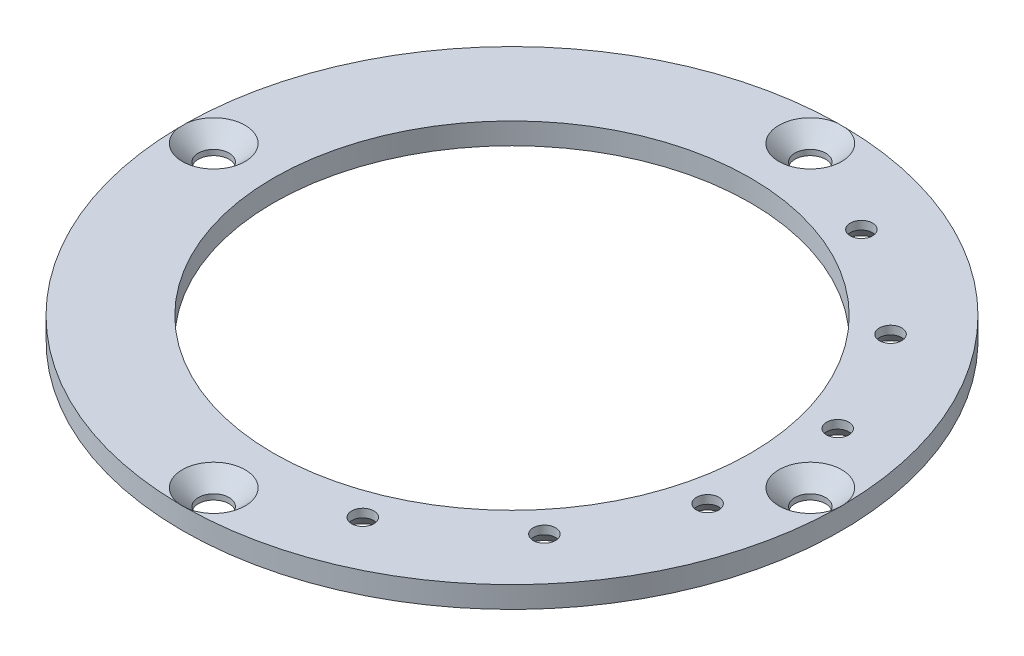
ISO-10303-21;
HEADER;
FILE_DESCRIPTION(('STEP AP214'),'2;1');
FILE_NAME('part.step','',(''),(''),'','','');
FILE_SCHEMA(('AUTOMOTIVE_DESIGN { 1 0 10303 214 1 1 1 1 }'));
ENDSEC;
DATA;
#1=APPLICATION_CONTEXT('core data for automotive mechanical design processes');
#2=APPLICATION_PROTOCOL_DEFINITION('international standard','automotive_design',2000,#1);
#3=PRODUCT_CONTEXT('',#1,'mechanical');
#4=PRODUCT('Part','Part','',(#3));
#5=PRODUCT_RELATED_PRODUCT_CATEGORY('part','',(#4));
#6=PRODUCT_DEFINITION_FORMATION('','',#4);
#7=PRODUCT_DEFINITION_CONTEXT('part definition',#1,'design');
#8=PRODUCT_DEFINITION('design','',#6,#7);
#9=PRODUCT_DEFINITION_SHAPE('','',#8);
#10=(LENGTH_UNIT() NAMED_UNIT(*) SI_UNIT(.MILLI.,.METRE.));
#11=(NAMED_UNIT(*) PLANE_ANGLE_UNIT() SI_UNIT($,.RADIAN.));
#12=(NAMED_UNIT(*) SI_UNIT($,.STERADIAN.) SOLID_ANGLE_UNIT());
#13=UNCERTAINTY_MEASURE_WITH_UNIT(LENGTH_MEASURE(1.E-05),#10,'distance_accuracy_value','');
#14=(GEOMETRIC_REPRESENTATION_CONTEXT(3) GLOBAL_UNCERTAINTY_ASSIGNED_CONTEXT((#13)) GLOBAL_UNIT_ASSIGNED_CONTEXT((#10,
#11,#12)) REPRESENTATION_CONTEXT('',''));
#15=CARTESIAN_POINT('',(0.,0.,0.));
#16=DIRECTION('',(0.,0.,1.));
#17=DIRECTION('',(1.,0.,0.));
#18=AXIS2_PLACEMENT_3D('',#15,#16,#17);
#19=CARTESIAN_POINT('',(0.,-43.48226,0.));
#20=DIRECTION('',(0.,1.,0.));
#21=DIRECTION('',(0.,0.,1.));
#22=AXIS2_PLACEMENT_3D('',#19,#20,#21);
#23=PLANE('',#22);
#24=CARTESIAN_POINT('',(14.6578770054185,-43.48226,-36.5145494448616));
#25=DIRECTION('',(0.,-1.,0.));
#26=DIRECTION('',(0.,0.,-1.));
#27=AXIS2_PLACEMENT_3D('',#24,#25,#26);
#28=CIRCLE('',#27,3.302);
#29=CARTESIAN_POINT('',(14.6578770054185,-43.48226,-39.8165494448616));
#30=VERTEX_POINT('',#29);
#31=EDGE_CURVE('E174',#30,#30,#28,.T.);
#32=ORIENTED_EDGE('',*,*,#31,.F.);
#33=EDGE_LOOP('',(#32));
#34=FACE_BOUND('',#33,.T.);
#35=CARTESIAN_POINT('',(0.,-43.48226,43.688));
#36=DIRECTION('',(0.,1.,0.));
#37=DIRECTION('',(0.,0.,1.));
#38=AXIS2_PLACEMENT_3D('',#35,#36,#37);
#39=CIRCLE('',#38,2.25);
#40=CARTESIAN_POINT('',(0.,-43.48226,45.938));
#41=VERTEX_POINT('',#40);
#42=EDGE_CURVE('E180',#41,#41,#39,.T.);
#43=ORIENTED_EDGE('',*,*,#42,.T.);
#44=EDGE_LOOP('',(#43));
#45=FACE_BOUND('',#44,.T.);
#46=CARTESIAN_POINT('',(43.688,-43.48226,0.));
#47=DIRECTION('',(0.,1.,0.));
#48=DIRECTION('',(0.,0.,1.));
#49=AXIS2_PLACEMENT_3D('',#46,#47,#48);
#50=CIRCLE('',#49,2.25);
#51=CARTESIAN_POINT('',(43.688,-43.48226,2.25));
#52=VERTEX_POINT('',#51);
#53=EDGE_CURVE('E188',#52,#52,#50,.T.);
#54=ORIENTED_EDGE('',*,*,#53,.T.);
#55=EDGE_LOOP('',(#54));
#56=FACE_BOUND('',#55,.T.);
#57=CARTESIAN_POINT('',(0.,-43.48226,-43.688));
#58=DIRECTION('',(0.,1.,0.));
#59=DIRECTION('',(0.,0.,1.));
#60=AXIS2_PLACEMENT_3D('',#57,#58,#59);
#61=CIRCLE('',#60,2.25);
#62=CARTESIAN_POINT('',(0.,-43.48226,-41.438));
#63=VERTEX_POINT('',#62);
#64=EDGE_CURVE('E197',#63,#63,#61,.T.);
#65=ORIENTED_EDGE('',*,*,#64,.T.);
#66=EDGE_LOOP('',(#65));
#67=FACE_BOUND('',#66,.T.);
#68=CARTESIAN_POINT('',(-43.688,-43.48226,0.));
#69=DIRECTION('',(0.,1.,0.));
#70=DIRECTION('',(0.,0.,1.));
#71=AXIS2_PLACEMENT_3D('',#68,#69,#70);
#72=CIRCLE('',#71,2.25);
#73=CARTESIAN_POINT('',(-43.688,-43.48226,2.25));
#74=VERTEX_POINT('',#73);
#75=EDGE_CURVE('E206',#74,#74,#72,.T.);
#76=ORIENTED_EDGE('',*,*,#75,.T.);
#77=EDGE_LOOP('',(#76));
#78=FACE_BOUND('',#77,.T.);
#79=CARTESIAN_POINT('',(0.,-43.48226,0.));
#80=DIRECTION('',(0.,1.,0.));
#81=DIRECTION('',(0.,0.,1.));
#82=AXIS2_PLACEMENT_3D('',#79,#80,#81);
#83=CIRCLE('',#82,48.26);
#84=CARTESIAN_POINT('',(0.,-43.48226,48.26));
#85=VERTEX_POINT('',#84);
#86=EDGE_CURVE('E111',#85,#85,#83,.F.);
#87=ORIENTED_EDGE('',*,*,#86,.T.);
#88=EDGE_LOOP('',(#87));
#89=FACE_BOUND('',#88,.T.);
#90=CARTESIAN_POINT('',(0.,-43.48226,0.));
#91=DIRECTION('',(0.,1.,0.));
#92=DIRECTION('',(0.,0.,1.));
#93=AXIS2_PLACEMENT_3D('',#90,#91,#92);
#94=CIRCLE('',#93,34.925);
#95=CARTESIAN_POINT('',(0.,-43.48226,34.925));
#96=VERTEX_POINT('',#95);
#97=EDGE_CURVE('E103',#96,#96,#94,.F.);
#98=ORIENTED_EDGE('',*,*,#97,.F.);
#99=EDGE_LOOP('',(#98));
#100=FACE_BOUND('',#99,.T.);
#101=CARTESIAN_POINT('',(30.0928655825076,-43.48226,-25.3492627210408));
#102=DIRECTION('',(0.,-1.,0.));
#103=DIRECTION('',(0.,0.,-1.));
#104=AXIS2_PLACEMENT_3D('',#101,#102,#103);
#105=CIRCLE('',#104,3.302);
#106=CARTESIAN_POINT('',(30.0928655825076,-43.48226,-28.6512627210408));
#107=VERTEX_POINT('',#106);
#108=EDGE_CURVE('E217',#107,#107,#105,.T.);
#109=ORIENTED_EDGE('',*,*,#108,.F.);
#110=EDGE_LOOP('',(#109));
#111=FACE_BOUND('',#110,.T.);
#112=CARTESIAN_POINT('',(38.1764332339628,-43.48226,-9.525));
#113=DIRECTION('',(0.,-1.,0.));
#114=DIRECTION('',(0.,0.,-1.));
#115=AXIS2_PLACEMENT_3D('',#112,#113,#114);
#116=CIRCLE('',#115,3.302);
#117=CARTESIAN_POINT('',(38.1764332339628,-43.48226,-12.827));
#118=VERTEX_POINT('',#117);
#119=EDGE_CURVE('E221',#118,#118,#116,.T.);
#120=ORIENTED_EDGE('',*,*,#119,.F.);
#121=EDGE_LOOP('',(#120));
#122=FACE_BOUND('',#121,.T.);
#123=CARTESIAN_POINT('',(38.1764332339628,-43.48226,9.525));
#124=DIRECTION('',(0.,-1.,0.));
#125=DIRECTION('',(0.,0.,-1.));
#126=AXIS2_PLACEMENT_3D('',#123,#124,#125);
#127=CIRCLE('',#126,3.302);
#128=CARTESIAN_POINT('',(38.1764332339628,-43.48226,6.223));
#129=VERTEX_POINT('',#128);
#130=EDGE_CURVE('E225',#129,#129,#127,.T.);
#131=ORIENTED_EDGE('',*,*,#130,.F.);
#132=EDGE_LOOP('',(#131));
#133=FACE_BOUND('',#132,.T.);
#134=CARTESIAN_POINT('',(30.0928655825076,-43.48226,25.3492627210408));
#135=DIRECTION('',(0.,-1.,0.));
#136=DIRECTION('',(0.,0.,-1.));
#137=AXIS2_PLACEMENT_3D('',#134,#135,#136);
#138=CIRCLE('',#137,3.302);
#139=CARTESIAN_POINT('',(30.0928655825076,-43.48226,22.0472627210408));
#140=VERTEX_POINT('',#139);
#141=EDGE_CURVE('E229',#140,#140,#138,.T.);
#142=ORIENTED_EDGE('',*,*,#141,.F.);
#143=EDGE_LOOP('',(#142));
#144=FACE_BOUND('',#143,.T.);
#145=CARTESIAN_POINT('',(14.6578770054184,-43.48226,36.5145494448616));
#146=DIRECTION('',(0.,-1.,0.));
#147=DIRECTION('',(0.,0.,-1.));
#148=AXIS2_PLACEMENT_3D('',#145,#146,#147);
#149=CIRCLE('',#148,3.302);
#150=CARTESIAN_POINT('',(14.6578770054184,-43.48226,33.2125494448616));
#151=VERTEX_POINT('',#150);
#152=EDGE_CURVE('E232',#151,#151,#149,.T.);
#153=ORIENTED_EDGE('',*,*,#152,.F.);
#154=EDGE_LOOP('',(#153));
#155=FACE_BOUND('',#154,.T.);
#156=ADVANCED_FACE('F42',(#34,#45,#56,#67,#78,#89,#100,#111,#122,#133,#144,#155),#23,.F.);
#157=CARTESIAN_POINT('',(0.,-179.982153040251,0.));
#158=DIRECTION('',(0.,1.,0.));
#159=DIRECTION('',(0.,0.,1.));
#160=AXIS2_PLACEMENT_3D('',#157,#158,#159);
#161=CYLINDRICAL_SURFACE('',#160,48.26);
#162=CARTESIAN_POINT('',(-4.43511365443474,-38.7078966717899,48.0557735019659));
#163=CARTESIAN_POINT('',(-4.3206800452195,-38.7820031314783,48.0663336499546));
#164=CARTESIAN_POINT('',(-4.20551369527138,-38.8550467916644,48.0765512327605));
#165=CARTESIAN_POINT('',(-3.97349761758106,-38.9985901295011,48.0962836738619));
#166=CARTESIAN_POINT('',(-3.85664736107759,-39.069088982582,48.1057983054137));
#167=CARTESIAN_POINT('',(-3.62031278244212,-39.2075483961708,48.1241630765065));
#168=CARTESIAN_POINT('',(-3.50081590532765,-39.2754882798996,48.1330082220251));
#169=CARTESIAN_POINT('',(-3.25978483419257,-39.4077337186415,48.1499325184922));
#170=CARTESIAN_POINT('',(-3.13825082839658,-39.4720396070509,48.1580117397557));
#171=CARTESIAN_POINT('',(-2.89129216778441,-39.5971653720733,48.1734733195204));
#172=CARTESIAN_POINT('',(-2.76583725544716,-39.6579274301162,48.1808449666575));
#173=CARTESIAN_POINT('',(-2.51245269859545,-39.7741493468478,48.1947227627606));
#174=CARTESIAN_POINT('',(-2.38452269348176,-39.8296084258379,48.2012287845082));
#175=CARTESIAN_POINT('',(-1.99749095493958,-39.9862153271572,48.2193332777023));
#176=CARTESIAN_POINT('',(-1.734298560819,-40.0780374659836,48.2295721736229));
#177=CARTESIAN_POINT('',(-1.3899651809606,-40.1737024120904,48.2400398840253));
#178=CARTESIAN_POINT('',(-1.31319618467855,-40.1935112961486,48.2421918080597));
#179=CARTESIAN_POINT('',(-1.15891422673548,-40.2300924726776,48.246144637927));
#180=CARTESIAN_POINT('',(-1.08140115894505,-40.2468643249806,48.2479454928811));
#181=CARTESIAN_POINT('',(-0.848353988689384,-40.2921986542366,48.2527923869871));
#182=CARTESIAN_POINT('',(-0.691829539323482,-40.3159163741734,48.2552975399763));
#183=CARTESIAN_POINT('',(-0.3572103836872,-40.351107855491,48.2590035264591));
#184=CARTESIAN_POINT('',(-0.178904349426157,-40.3606405684994,48.2599979315682));
#185=CARTESIAN_POINT('',(0.178116710733451,-40.3606794052499,48.2600020657617));
#186=CARTESIAN_POINT('',(0.356831771339242,-40.3511435193675,48.2590074127944));
#187=CARTESIAN_POINT('',(0.670128644816814,-40.3182018006531,48.2555381167261));
#188=CARTESIAN_POINT('',(0.805137595163514,-40.298616134564,48.2534698206685));
#189=CARTESIAN_POINT('',(1.07343277468439,-40.2496369235557,48.2482471245083));
#190=CARTESIAN_POINT('',(1.206717726047,-40.2202364932956,48.2450919618877));
#191=CARTESIAN_POINT('',(1.47079910683963,-40.1527758900891,48.2377630105055));
#192=CARTESIAN_POINT('',(1.6015989930196,-40.1147288729097,48.2335907685349));
#193=CARTESIAN_POINT('',(1.86054533245197,-40.0311716975152,48.2242961909687));
#194=CARTESIAN_POINT('',(1.98869558010789,-39.9856731845126,48.2191753362556));
#195=CARTESIAN_POINT('',(2.11553812765031,-39.9369979899687,48.2136090583401));
#196=B_SPLINE_CURVE_WITH_KNOTS('',3,(#162,#163,#164,#165,#166,#167,#168,#169,#170,#171,#172,
#173,#174,#175,#176,#177,#178,#179,#180,#181,#182,#183,#184,#185,#186,#187,#188,#189,#190,#191,
#192,#193,#194,#195),.UNSPECIFIED.,.F.,.F.,(4,2,2,2,2,2,2,2,2,2,2,2,2,2,2,2,4),(0.,
0.410234899965599,0.82060155258797,1.2337770491434,1.64691457768576,2.06555315814155,
2.48425319682157,3.3187823671808,3.5566737995499,3.79459968283002,4.26895150121379,
4.80363744333187,5.33950263844922,5.74844447776585,6.15767380660287,6.56628461353248,
6.97426283175265),.UNSPECIFIED.);
#197=CARTESIAN_POINT('',(-0.532619427072993,-40.33266,48.2570607947263));
#198=VERTEX_POINT('',#197);
#199=CARTESIAN_POINT('',(0.532619427073456,-40.33266,48.2570607947262));
#200=VERTEX_POINT('',#199);
#201=EDGE_CURVE('E11',#198,#200,#196,.T.);
#202=ORIENTED_EDGE('',*,*,#201,.F.);
#203=CARTESIAN_POINT('',(0.,-40.33266,0.));
#204=DIRECTION('',(0.,1.,0.));
#205=DIRECTION('',(0.,0.,1.));
#206=AXIS2_PLACEMENT_3D('',#203,#204,#205);
#207=CIRCLE('',#206,48.26);
#208=CARTESIAN_POINT('',(-48.2570607947262,-40.33266,0.532619427073456));
#209=VERTEX_POINT('',#208);
#210=EDGE_CURVE('E94',#209,#198,#207,.T.);
#211=ORIENTED_EDGE('',*,*,#210,.F.);
#212=CARTESIAN_POINT('',(-48.0557735019659,-38.7078966717899,-4.43511365443474));
#213=CARTESIAN_POINT('',(-48.0663336499546,-38.7820031314783,-4.32068004521949));
#214=CARTESIAN_POINT('',(-48.0765512327605,-38.8550467916644,-4.20551369527138));
#215=CARTESIAN_POINT('',(-48.0962836738619,-38.9985901295011,-3.97349761758106));
#216=CARTESIAN_POINT('',(-48.1057983054137,-39.069088982582,-3.85664736107759));
#217=CARTESIAN_POINT('',(-48.1241630765065,-39.2075483961708,-3.62031278244212));
#218=CARTESIAN_POINT('',(-48.1330082220251,-39.2754882798996,-3.50081590532765));
#219=CARTESIAN_POINT('',(-48.1499325184922,-39.4077337186415,-3.25978483419257));
#220=CARTESIAN_POINT('',(-48.1580117397557,-39.4720396070508,-3.13825082839658));
#221=CARTESIAN_POINT('',(-48.1734733195204,-39.5971653720733,-2.89129216778442));
#222=CARTESIAN_POINT('',(-48.1808449666575,-39.6579274301162,-2.76583725544717));
#223=CARTESIAN_POINT('',(-48.1947227627606,-39.7741493468478,-2.51245269859546));
#224=CARTESIAN_POINT('',(-48.2012287845082,-39.8296084258379,-2.38452269348177));
#225=CARTESIAN_POINT('',(-48.2193332777023,-39.9862153271572,-1.99749095493959));
#226=CARTESIAN_POINT('',(-48.2295721736229,-40.0780374659836,-1.73429856081901));
#227=CARTESIAN_POINT('',(-48.2400398840253,-40.1737024120904,-1.3899651809606));
#228=CARTESIAN_POINT('',(-48.2421918080597,-40.1935112961486,-1.31319618467855));
#229=CARTESIAN_POINT('',(-48.246144637927,-40.2300924726776,-1.15891422673549));
#230=CARTESIAN_POINT('',(-48.2479454928811,-40.2468643249806,-1.08140115894505));
#231=CARTESIAN_POINT('',(-48.2527923869871,-40.2921986542366,-0.848353988689384));
#232=CARTESIAN_POINT('',(-48.2552975399763,-40.3159163741735,-0.69182953932348));
#233=CARTESIAN_POINT('',(-48.2590035264591,-40.351107855491,-0.357210383687196));
#234=CARTESIAN_POINT('',(-48.2599979315682,-40.3606405684994,-0.178904349426154));
#235=CARTESIAN_POINT('',(-48.2600020657617,-40.3606794052499,0.178116710733453));
#236=CARTESIAN_POINT('',(-48.2590074127944,-40.3511435193675,0.356831771339243));
#237=CARTESIAN_POINT('',(-48.2555381167261,-40.3182018006531,0.670128644816814));
#238=CARTESIAN_POINT('',(-48.2534698206685,-40.298616134564,0.805137595163514));
#239=CARTESIAN_POINT('',(-48.2482471245083,-40.2496369235557,1.07343277468439));
#240=CARTESIAN_POINT('',(-48.2450919618877,-40.2202364932956,1.206717726047));
#241=CARTESIAN_POINT('',(-48.2377630105055,-40.1527758900891,1.47079910683962));
#242=CARTESIAN_POINT('',(-48.2335907685349,-40.1147288729097,1.6015989930196));
#243=CARTESIAN_POINT('',(-48.2242961909687,-40.0311716975152,1.86054533245197));
#244=CARTESIAN_POINT('',(-48.2191753362556,-39.9856731845126,1.98869558010789));
#245=CARTESIAN_POINT('',(-48.2136090583401,-39.9369979899687,2.11553812765031));
#246=B_SPLINE_CURVE_WITH_KNOTS('',3,(#212,#213,#214,#215,#216,#217,#218,#219,#220,#221,#222,
#223,#224,#225,#226,#227,#228,#229,#230,#231,#232,#233,#234,#235,#236,#237,#238,#239,#240,#241,
#242,#243,#244,#245),.UNSPECIFIED.,.F.,.F.,(4,2,2,2,2,2,2,2,2,2,2,2,2,2,2,2,4),(0.,
0.410234899965598,0.820601552587967,1.2337770491434,1.64691457768575,2.06555315814153,
2.48425319682155,3.31878236718079,3.5566737995499,3.79459968283002,4.2689515012138,
4.80363744333187,5.33950263844921,5.74844447776585,6.15767380660287,6.56628461353248,
6.97426283175264),.UNSPECIFIED.);
#247=CARTESIAN_POINT('',(-48.2570607947263,-40.33266,-0.532619427072989));
#248=VERTEX_POINT('',#247);
#249=EDGE_CURVE('E112',#248,#209,#246,.T.);
#250=ORIENTED_EDGE('',*,*,#249,.F.);
#251=CARTESIAN_POINT('',(-0.532619427073456,-40.33266,-48.2570607947262));
#252=VERTEX_POINT('',#251);
#253=EDGE_CURVE('E104',#252,#248,#207,.T.);
#254=ORIENTED_EDGE('',*,*,#253,.F.);
#255=CARTESIAN_POINT('',(2.11553812765031,-39.9369979899687,-48.2136090583401));
#256=CARTESIAN_POINT('',(1.98873401290734,-39.985658423565,-48.2191736484954));
#257=CARTESIAN_POINT('',(1.86062305429761,-40.0311440966863,-48.224293084562));
#258=CARTESIAN_POINT('',(1.6017577450666,-40.1146801682437,-48.2335853869341));
#259=CARTESIAN_POINT('',(1.47099962023972,-40.1527189841909,-48.2377567802949));
#260=CARTESIAN_POINT('',(1.20692223507146,-40.2201899305417,-48.245086951529));
#261=CARTESIAN_POINT('',(1.0735981202033,-40.2496035887385,-48.2482435574381));
#262=CARTESIAN_POINT('',(0.805221795665676,-40.2986039093656,-48.2534685295766));
#263=CARTESIAN_POINT('',(0.670170844883565,-40.3181973539068,-48.2555376469039));
#264=CARTESIAN_POINT('',(0.356782634654057,-40.3511486984476,-48.2590079602111));
#265=CARTESIAN_POINT('',(0.178018165509056,-40.3606846771676,-48.2600026246289));
#266=CARTESIAN_POINT('',(-0.17900416299521,-40.3606352827661,-48.2599973712942));
#267=CARTESIAN_POINT('',(-0.357262061665193,-40.3511024995423,-48.2590029392877));
#268=CARTESIAN_POINT('',(-0.700893501169603,-40.3149630544468,-48.2551971683644));
#269=CARTESIAN_POINT('',(-0.866385679058802,-40.2894415521649,-48.2525012305828));
#270=CARTESIAN_POINT('',(-1.19451119481474,-40.2239751754148,-48.2454941066491));
#271=CARTESIAN_POINT('',(-1.35714276033423,-40.1840216680402,-48.2411819536545));
#272=CARTESIAN_POINT('',(-1.68009332766718,-40.0914246741657,-48.2310192182759));
#273=CARTESIAN_POINT('',(-1.84038246877528,-40.0386799073589,-48.225156321824));
#274=CARTESIAN_POINT('',(-2.15706021043792,-39.9228710881826,-48.2120297218672));
#275=CARTESIAN_POINT('',(-2.31344926740518,-39.8598082498923,-48.2047661831516));
#276=CARTESIAN_POINT('',(-2.64166783089074,-39.7169634527078,-48.1879596082474));
#277=CARTESIAN_POINT('',(-2.81300444637099,-39.6360778454605,-48.1782455399448));
#278=CARTESIAN_POINT('',(-3.1514277615533,-39.4659815458656,-48.1572928063255));
#279=CARTESIAN_POINT('',(-3.31851304793247,-39.3767681298523,-48.1460536416666));
#280=CARTESIAN_POINT('',(-3.64568400680086,-39.1936271782086,-48.1223750820518));
#281=CARTESIAN_POINT('',(-3.80584263089298,-39.0998253784845,-48.109963342714));
#282=CARTESIAN_POINT('',(-4.12281850630506,-38.9072812319718,-48.0838344449272));
#283=CARTESIAN_POINT('',(-4.27963924955711,-38.8085444508772,-48.0701187420127));
#284=CARTESIAN_POINT('',(-4.43511365443474,-38.7078966717899,-48.0557735019659));
#285=B_SPLINE_CURVE_WITH_KNOTS('',3,(#255,#256,#257,#258,#259,#260,#261,#262,#263,#264,#265,
#266,#267,#268,#269,#270,#271,#272,#273,#274,#275,#276,#277,#278,#279,#280,#281,#282,#283,#284),
.UNSPECIFIED.,.F.,.F.,(4,2,2,2,2,2,2,2,2,2,2,2,2,2,4),(0.,0.407854484931988,0.816338373619181,
1.22569081378559,1.63476015294158,2.17077384028202,2.70531128912839,3.20700220334111,
3.70899371629217,4.21509776196209,4.72114229950376,5.28999849410147,5.85904139316573,
6.41699579286857,6.97433453576174),.UNSPECIFIED.);
#286=CARTESIAN_POINT('',(0.53261942707299,-40.33266,-48.2570607947263));
#287=VERTEX_POINT('',#286);
#288=EDGE_CURVE('E119',#287,#252,#285,.T.);
#289=ORIENTED_EDGE('',*,*,#288,.F.);
#290=CARTESIAN_POINT('',(48.2570607947262,-40.33266,-0.532619427073456));
#291=VERTEX_POINT('',#290);
#292=EDGE_CURVE('E101',#291,#287,#207,.T.);
#293=ORIENTED_EDGE('',*,*,#292,.F.);
#294=CARTESIAN_POINT('',(48.2136090583401,-39.9369979899687,2.11553812765031));
#295=CARTESIAN_POINT('',(48.2191736484954,-39.985658423565,1.98873401290733));
#296=CARTESIAN_POINT('',(48.224293084562,-40.0311440966863,1.86062305429761));
#297=CARTESIAN_POINT('',(48.2335853869341,-40.1146801682437,1.60175774506659));
#298=CARTESIAN_POINT('',(48.2377567802949,-40.1527189841909,1.47099962023972));
#299=CARTESIAN_POINT('',(48.245086951529,-40.2201899305417,1.20692223507146));
#300=CARTESIAN_POINT('',(48.2482435574381,-40.2496035887385,1.0735981202033));
#301=CARTESIAN_POINT('',(48.2534685295766,-40.2986039093656,0.805221795665678));
#302=CARTESIAN_POINT('',(48.2555376469039,-40.3181973539068,0.670170844883566));
#303=CARTESIAN_POINT('',(48.2590079602111,-40.3511486984476,0.356782634654057));
#304=CARTESIAN_POINT('',(48.2600026246289,-40.3606846771676,0.178018165509058));
#305=CARTESIAN_POINT('',(48.2599973712942,-40.3606352827661,-0.179004162995208));
#306=CARTESIAN_POINT('',(48.2590029392877,-40.3511024995423,-0.35726206166519));
#307=CARTESIAN_POINT('',(48.2551971683644,-40.3149630544468,-0.700893501169599));
#308=CARTESIAN_POINT('',(48.2525012305828,-40.2894415521649,-0.866385679058798));
#309=CARTESIAN_POINT('',(48.2454941066491,-40.2239751754148,-1.19451119481474));
#310=CARTESIAN_POINT('',(48.2411819536545,-40.1840216680402,-1.35714276033422));
#311=CARTESIAN_POINT('',(48.2310192182759,-40.0914246741657,-1.68009332766717));
#312=CARTESIAN_POINT('',(48.225156321824,-40.0386799073589,-1.84038246877527));
#313=CARTESIAN_POINT('',(48.2120297218672,-39.9228710881826,-2.15706021043792));
#314=CARTESIAN_POINT('',(48.2047661831516,-39.8598082498923,-2.31344926740518));
#315=CARTESIAN_POINT('',(48.1879596082474,-39.7169634527078,-2.64166783089073));
#316=CARTESIAN_POINT('',(48.1782455399448,-39.6360778454605,-2.81300444637098));
#317=CARTESIAN_POINT('',(48.1572928063255,-39.4659815458656,-3.15142776155329));
#318=CARTESIAN_POINT('',(48.1460536416666,-39.3767681298523,-3.31851304793247));
#319=CARTESIAN_POINT('',(48.1223750820518,-39.1936271782086,-3.64568400680085));
#320=CARTESIAN_POINT('',(48.109963342714,-39.0998253784845,-3.80584263089298));
#321=CARTESIAN_POINT('',(48.0838344449272,-38.9072812319718,-4.12281850630506));
#322=CARTESIAN_POINT('',(48.0701187420127,-38.8085444508772,-4.27963924955711));
#323=CARTESIAN_POINT('',(48.0557735019659,-38.7078966717899,-4.43511365443473));
#324=B_SPLINE_CURVE_WITH_KNOTS('',3,(#294,#295,#296,#297,#298,#299,#300,#301,#302,#303,#304,
#305,#306,#307,#308,#309,#310,#311,#312,#313,#314,#315,#316,#317,#318,#319,#320,#321,#322,#323),
.UNSPECIFIED.,.F.,.F.,(4,2,2,2,2,2,2,2,2,2,2,2,2,2,4),(0.,0.407854484931986,0.816338373619179,
1.22569081378558,1.63476015294157,2.17077384028201,2.70531128912839,3.20700220334111,
3.70899371629216,4.21509776196208,4.72114229950375,5.28999849410145,5.85904139316572,
6.41699579286856,6.97433453576173),.UNSPECIFIED.);
#325=CARTESIAN_POINT('',(48.2570607947263,-40.33266,0.532619427072991));
#326=VERTEX_POINT('',#325);
#327=EDGE_CURVE('E56',#326,#291,#324,.T.);
#328=ORIENTED_EDGE('',*,*,#327,.F.);
#329=EDGE_CURVE('E68',#200,#326,#207,.T.);
#330=ORIENTED_EDGE('',*,*,#329,.F.);
#331=EDGE_LOOP('',(#202,#211,#250,#254,#289,#293,#328,#330));
#332=FACE_BOUND('',#331,.T.);
#333=ORIENTED_EDGE('',*,*,#86,.F.);
#334=EDGE_LOOP('',(#333));
#335=FACE_BOUND('',#334,.T.);
#336=ADVANCED_FACE('F44',(#332,#335),#161,.T.);
#337=CARTESIAN_POINT('',(0.,-40.33266,0.));
#338=DIRECTION('',(0.,1.,0.));
#339=DIRECTION('',(0.,0.,1.));
#340=AXIS2_PLACEMENT_3D('',#337,#338,#339);
#341=PLANE('',#340);
#342=CARTESIAN_POINT('',(14.6578770054184,-40.33266,36.5145494448616));
#343=DIRECTION('',(0.,1.,0.));
#344=DIRECTION('',(0.,0.,1.));
#345=AXIS2_PLACEMENT_3D('',#342,#343,#344);
#346=CIRCLE('',#345,1.63195);
#347=CARTESIAN_POINT('',(14.6578770054184,-40.33266,38.1464994448616));
#348=VERTEX_POINT('',#347);
#349=EDGE_CURVE('E151',#348,#348,#346,.T.);
#350=ORIENTED_EDGE('',*,*,#349,.F.);
#351=EDGE_LOOP('',(#350));
#352=FACE_BOUND('',#351,.T.);
#353=CARTESIAN_POINT('',(30.0928655825076,-40.33266,25.3492627210408));
#354=DIRECTION('',(0.,1.,0.));
#355=DIRECTION('',(0.,0.,1.));
#356=AXIS2_PLACEMENT_3D('',#353,#354,#355);
#357=CIRCLE('',#356,1.63195);
#358=CARTESIAN_POINT('',(30.0928655825076,-40.33266,26.9812127210408));
#359=VERTEX_POINT('',#358);
#360=EDGE_CURVE('E155',#359,#359,#357,.T.);
#361=ORIENTED_EDGE('',*,*,#360,.F.);
#362=EDGE_LOOP('',(#361));
#363=FACE_BOUND('',#362,.T.);
#364=CARTESIAN_POINT('',(38.1764332339628,-40.33266,9.525));
#365=DIRECTION('',(0.,1.,0.));
#366=DIRECTION('',(0.,0.,1.));
#367=AXIS2_PLACEMENT_3D('',#364,#365,#366);
#368=CIRCLE('',#367,1.63195);
#369=CARTESIAN_POINT('',(38.1764332339628,-40.33266,11.15695));
#370=VERTEX_POINT('',#369);
#371=EDGE_CURVE('E159',#370,#370,#368,.T.);
#372=ORIENTED_EDGE('',*,*,#371,.F.);
#373=EDGE_LOOP('',(#372));
#374=FACE_BOUND('',#373,.T.);
#375=CARTESIAN_POINT('',(38.1764332339628,-40.33266,-9.525));
#376=DIRECTION('',(0.,1.,0.));
#377=DIRECTION('',(0.,0.,1.));
#378=AXIS2_PLACEMENT_3D('',#375,#376,#377);
#379=CIRCLE('',#378,1.63195);
#380=CARTESIAN_POINT('',(38.1764332339628,-40.33266,-7.89305));
#381=VERTEX_POINT('',#380);
#382=EDGE_CURVE('E163',#381,#381,#379,.T.);
#383=ORIENTED_EDGE('',*,*,#382,.F.);
#384=EDGE_LOOP('',(#383));
#385=FACE_BOUND('',#384,.T.);
#386=CARTESIAN_POINT('',(30.0928655825076,-40.33266,-25.3492627210408));
#387=DIRECTION('',(0.,1.,0.));
#388=DIRECTION('',(0.,0.,1.));
#389=AXIS2_PLACEMENT_3D('',#386,#387,#388);
#390=CIRCLE('',#389,1.63195);
#391=CARTESIAN_POINT('',(30.0928655825076,-40.33266,-23.7173127210408));
#392=VERTEX_POINT('',#391);
#393=EDGE_CURVE('E167',#392,#392,#390,.T.);
#394=ORIENTED_EDGE('',*,*,#393,.F.);
#395=EDGE_LOOP('',(#394));
#396=FACE_BOUND('',#395,.T.);
#397=CARTESIAN_POINT('',(14.6578770054185,-40.33266,-36.5145494448616));
#398=DIRECTION('',(0.,1.,0.));
#399=DIRECTION('',(0.,0.,1.));
#400=AXIS2_PLACEMENT_3D('',#397,#398,#399);
#401=CIRCLE('',#400,1.63195);
#402=CARTESIAN_POINT('',(14.6578770054185,-40.33266,-34.8825994448616));
#403=VERTEX_POINT('',#402);
#404=EDGE_CURVE('E96',#403,#403,#401,.T.);
#405=ORIENTED_EDGE('',*,*,#404,.F.);
#406=EDGE_LOOP('',(#405));
#407=FACE_BOUND('',#406,.T.);
#408=CARTESIAN_POINT('',(0.,-40.33266,43.688));
#409=DIRECTION('',(0.,1.,0.));
#410=DIRECTION('',(0.,0.,1.));
#411=AXIS2_PLACEMENT_3D('',#408,#409,#410);
#412=CIRCLE('',#411,4.6);
#413=EDGE_CURVE('E61',#200,#198,#412,.T.);
#414=ORIENTED_EDGE('',*,*,#413,.F.);
#415=ORIENTED_EDGE('',*,*,#329,.T.);
#416=CARTESIAN_POINT('',(43.688,-40.33266,0.));
#417=DIRECTION('',(0.,1.,0.));
#418=DIRECTION('',(0.,0.,1.));
#419=AXIS2_PLACEMENT_3D('',#416,#417,#418);
#420=CIRCLE('',#419,4.6);
#421=EDGE_CURVE('E183',#291,#326,#420,.T.);
#422=ORIENTED_EDGE('',*,*,#421,.F.);
#423=ORIENTED_EDGE('',*,*,#292,.T.);
#424=CARTESIAN_POINT('',(0.,-40.33266,-43.688));
#425=DIRECTION('',(0.,1.,0.));
#426=DIRECTION('',(0.,0.,1.));
#427=AXIS2_PLACEMENT_3D('',#424,#425,#426);
#428=CIRCLE('',#427,4.6);
#429=EDGE_CURVE('E191',#252,#287,#428,.T.);
#430=ORIENTED_EDGE('',*,*,#429,.F.);
#431=ORIENTED_EDGE('',*,*,#253,.T.);
#432=CARTESIAN_POINT('',(-43.688,-40.33266,0.));
#433=DIRECTION('',(0.,1.,0.));
#434=DIRECTION('',(0.,0.,1.));
#435=AXIS2_PLACEMENT_3D('',#432,#433,#434);
#436=CIRCLE('',#435,4.6);
#437=EDGE_CURVE('E200',#209,#248,#436,.T.);
#438=ORIENTED_EDGE('',*,*,#437,.F.);
#439=ORIENTED_EDGE('',*,*,#210,.T.);
#440=EDGE_LOOP('',(#414,#415,#422,#423,#430,#431,#438,#439));
#441=FACE_BOUND('',#440,.T.);
#442=CARTESIAN_POINT('',(0.,-40.33266,0.));
#443=DIRECTION('',(0.,1.,0.));
#444=DIRECTION('',(0.,0.,1.));
#445=AXIS2_PLACEMENT_3D('',#442,#443,#444);
#446=CIRCLE('',#445,34.925);
#447=CARTESIAN_POINT('',(0.,-40.33266,34.925));
#448=VERTEX_POINT('',#447);
#449=EDGE_CURVE('E107',#448,#448,#446,.T.);
#450=ORIENTED_EDGE('',*,*,#449,.F.);
#451=EDGE_LOOP('',(#450));
#452=FACE_BOUND('',#451,.T.);
#453=ADVANCED_FACE('F91',(#352,#363,#374,#385,#396,#407,#441,#452),#341,.T.);
#454=CARTESIAN_POINT('',(0.,-179.982153040251,0.));
#455=DIRECTION('',(0.,1.,0.));
#456=DIRECTION('',(0.,0.,1.));
#457=AXIS2_PLACEMENT_3D('',#454,#455,#456);
#458=CYLINDRICAL_SURFACE('',#457,34.925);
#459=ORIENTED_EDGE('',*,*,#97,.T.);
#460=EDGE_LOOP('',(#459));
#461=FACE_BOUND('',#460,.T.);
#462=ORIENTED_EDGE('',*,*,#449,.T.);
#463=EDGE_LOOP('',(#462));
#464=FACE_BOUND('',#463,.T.);
#465=ADVANCED_FACE('F135',(#461,#464),#458,.F.);
#466=CARTESIAN_POINT('',(-43.688,-40.33266,0.));
#467=DIRECTION('',(0.,1.,0.));
#468=DIRECTION('',(0.,0.,1.));
#469=AXIS2_PLACEMENT_3D('',#466,#467,#468);
#470=CYLINDRICAL_SURFACE('',#469,2.25);
#471=ORIENTED_EDGE('',*,*,#75,.F.);
#472=EDGE_LOOP('',(#471));
#473=FACE_BOUND('',#472,.T.);
#474=CARTESIAN_POINT('',(-43.688,-42.68266,0.));
#475=DIRECTION('',(0.,1.,0.));
#476=DIRECTION('',(0.,0.,1.));
#477=AXIS2_PLACEMENT_3D('',#474,#475,#476);
#478=CIRCLE('',#477,2.25);
#479=CARTESIAN_POINT('',(-43.688,-42.68266,2.25));
#480=VERTEX_POINT('',#479);
#481=EDGE_CURVE('E203',#480,#480,#478,.T.);
#482=ORIENTED_EDGE('',*,*,#481,.T.);
#483=EDGE_LOOP('',(#482));
#484=FACE_BOUND('',#483,.T.);
#485=ADVANCED_FACE('F131',(#473,#484),#470,.F.);
#486=CARTESIAN_POINT('',(-43.688,-40.33266,0.));
#487=DIRECTION('',(0.,1.,0.));
#488=DIRECTION('',(0.,0.,1.));
#489=AXIS2_PLACEMENT_3D('',#486,#487,#488);
#490=CONICAL_SURFACE('',#489,4.6,0.785398163397448);
#491=ORIENTED_EDGE('',*,*,#249,.T.);
#492=ORIENTED_EDGE('',*,*,#437,.T.);
#493=EDGE_LOOP('',(#491,#492));
#494=FACE_BOUND('',#493,.T.);
#495=ORIENTED_EDGE('',*,*,#481,.F.);
#496=EDGE_LOOP('',(#495));
#497=FACE_BOUND('',#496,.T.);
#498=ADVANCED_FACE('F125',(#494,#497),#490,.F.);
#499=CARTESIAN_POINT('',(0.,-40.33266,-43.688));
#500=DIRECTION('',(0.,1.,0.));
#501=DIRECTION('',(0.,0.,1.));
#502=AXIS2_PLACEMENT_3D('',#499,#500,#501);
#503=CYLINDRICAL_SURFACE('',#502,2.25);
#504=ORIENTED_EDGE('',*,*,#64,.F.);
#505=EDGE_LOOP('',(#504));
#506=FACE_BOUND('',#505,.T.);
#507=CARTESIAN_POINT('',(0.,-42.68266,-43.688));
#508=DIRECTION('',(0.,1.,0.));
#509=DIRECTION('',(0.,0.,1.));
#510=AXIS2_PLACEMENT_3D('',#507,#508,#509);
#511=CIRCLE('',#510,2.25);
#512=CARTESIAN_POINT('',(0.,-42.68266,-41.438));
#513=VERTEX_POINT('',#512);
#514=EDGE_CURVE('E194',#513,#513,#511,.T.);
#515=ORIENTED_EDGE('',*,*,#514,.T.);
#516=EDGE_LOOP('',(#515));
#517=FACE_BOUND('',#516,.T.);
#518=ADVANCED_FACE('F130',(#506,#517),#503,.F.);
#519=CARTESIAN_POINT('',(0.,-40.33266,-43.688));
#520=DIRECTION('',(0.,1.,0.));
#521=DIRECTION('',(0.,0.,1.));
#522=AXIS2_PLACEMENT_3D('',#519,#520,#521);
#523=CONICAL_SURFACE('',#522,4.6,0.785398163397449);
#524=ORIENTED_EDGE('',*,*,#288,.T.);
#525=ORIENTED_EDGE('',*,*,#429,.T.);
#526=EDGE_LOOP('',(#524,#525));
#527=FACE_BOUND('',#526,.T.);
#528=ORIENTED_EDGE('',*,*,#514,.F.);
#529=EDGE_LOOP('',(#528));
#530=FACE_BOUND('',#529,.T.);
#531=ADVANCED_FACE('F277',(#527,#530),#523,.F.);
#532=CARTESIAN_POINT('',(43.688,-40.33266,0.));
#533=DIRECTION('',(0.,1.,0.));
#534=DIRECTION('',(0.,0.,1.));
#535=AXIS2_PLACEMENT_3D('',#532,#533,#534);
#536=CYLINDRICAL_SURFACE('',#535,2.25);
#537=ORIENTED_EDGE('',*,*,#53,.F.);
#538=EDGE_LOOP('',(#537));
#539=FACE_BOUND('',#538,.T.);
#540=CARTESIAN_POINT('',(43.688,-42.68266,0.));
#541=DIRECTION('',(0.,1.,0.));
#542=DIRECTION('',(0.,0.,1.));
#543=AXIS2_PLACEMENT_3D('',#540,#541,#542);
#544=CIRCLE('',#543,2.25);
#545=CARTESIAN_POINT('',(43.688,-42.68266,2.25));
#546=VERTEX_POINT('',#545);
#547=EDGE_CURVE('E185',#546,#546,#544,.T.);
#548=ORIENTED_EDGE('',*,*,#547,.T.);
#549=EDGE_LOOP('',(#548));
#550=FACE_BOUND('',#549,.T.);
#551=ADVANCED_FACE('F281',(#539,#550),#536,.F.);
#552=CARTESIAN_POINT('',(43.688,-40.33266,0.));
#553=DIRECTION('',(0.,1.,0.));
#554=DIRECTION('',(0.,0.,1.));
#555=AXIS2_PLACEMENT_3D('',#552,#553,#554);
#556=CONICAL_SURFACE('',#555,4.6,0.785398163397448);
#557=ORIENTED_EDGE('',*,*,#327,.T.);
#558=ORIENTED_EDGE('',*,*,#421,.T.);
#559=EDGE_LOOP('',(#557,#558));
#560=FACE_BOUND('',#559,.T.);
#561=ORIENTED_EDGE('',*,*,#547,.F.);
#562=EDGE_LOOP('',(#561));
#563=FACE_BOUND('',#562,.T.);
#564=ADVANCED_FACE('F286',(#560,#563),#556,.F.);
#565=CARTESIAN_POINT('',(0.,-40.33266,43.688));
#566=DIRECTION('',(0.,1.,0.));
#567=DIRECTION('',(0.,0.,1.));
#568=AXIS2_PLACEMENT_3D('',#565,#566,#567);
#569=CYLINDRICAL_SURFACE('',#568,2.25);
#570=ORIENTED_EDGE('',*,*,#42,.F.);
#571=EDGE_LOOP('',(#570));
#572=FACE_BOUND('',#571,.T.);
#573=CARTESIAN_POINT('',(0.,-42.68266,43.688));
#574=DIRECTION('',(0.,1.,0.));
#575=DIRECTION('',(0.,0.,1.));
#576=AXIS2_PLACEMENT_3D('',#573,#574,#575);
#577=CIRCLE('',#576,2.25);
#578=CARTESIAN_POINT('',(0.,-42.68266,45.938));
#579=VERTEX_POINT('',#578);
#580=EDGE_CURVE('E95',#579,#579,#577,.T.);
#581=ORIENTED_EDGE('',*,*,#580,.T.);
#582=EDGE_LOOP('',(#581));
#583=FACE_BOUND('',#582,.T.);
#584=ADVANCED_FACE('F294',(#572,#583),#569,.F.);
#585=CARTESIAN_POINT('',(0.,-40.33266,43.688));
#586=DIRECTION('',(0.,1.,0.));
#587=DIRECTION('',(0.,0.,1.));
#588=AXIS2_PLACEMENT_3D('',#585,#586,#587);
#589=CONICAL_SURFACE('',#588,4.6,0.785398163397449);
#590=ORIENTED_EDGE('',*,*,#201,.T.);
#591=ORIENTED_EDGE('',*,*,#413,.T.);
#592=EDGE_LOOP('',(#590,#591));
#593=FACE_BOUND('',#592,.T.);
#594=ORIENTED_EDGE('',*,*,#580,.F.);
#595=EDGE_LOOP('',(#594));
#596=FACE_BOUND('',#595,.T.);
#597=ADVANCED_FACE('F86',(#593,#596),#589,.F.);
#598=CARTESIAN_POINT('',(14.6578770054185,-43.48226,-36.5145494448616));
#599=DIRECTION('',(0.,-1.,0.));
#600=DIRECTION('',(0.,0.,-1.));
#601=AXIS2_PLACEMENT_3D('',#598,#599,#600);
#602=CYLINDRICAL_SURFACE('',#601,1.63195);
#603=CARTESIAN_POINT('',(14.6578770054185,-41.5610872415206,-36.5145494448616));
#604=DIRECTION('',(0.,-1.,0.));
#605=DIRECTION('',(0.,0.,-1.));
#606=AXIS2_PLACEMENT_3D('',#603,#604,#605);
#607=CIRCLE('',#606,1.63195);
#608=CARTESIAN_POINT('',(14.6578770054185,-41.5610872415206,-38.1464994448616));
#609=VERTEX_POINT('',#608);
#610=EDGE_CURVE('E171',#609,#609,#607,.T.);
#611=ORIENTED_EDGE('',*,*,#610,.T.);
#612=EDGE_LOOP('',(#611));
#613=FACE_BOUND('',#612,.T.);
#614=ORIENTED_EDGE('',*,*,#404,.T.);
#615=EDGE_LOOP('',(#614));
#616=FACE_BOUND('',#615,.T.);
#617=ADVANCED_FACE('F315',(#613,#616),#602,.F.);
#618=CARTESIAN_POINT('',(14.6578770054185,-43.48226,-36.5145494448616));
#619=DIRECTION('',(0.,-1.,0.));
#620=DIRECTION('',(0.,0.,-1.));
#621=AXIS2_PLACEMENT_3D('',#618,#619,#620);
#622=CONICAL_SURFACE('',#621,3.302,0.715584993317676);
#623=ORIENTED_EDGE('',*,*,#610,.F.);
#624=EDGE_LOOP('',(#623));
#625=FACE_BOUND('',#624,.T.);
#626=ORIENTED_EDGE('',*,*,#31,.T.);
#627=EDGE_LOOP('',(#626));
#628=FACE_BOUND('',#627,.T.);
#629=ADVANCED_FACE('F262',(#625,#628),#622,.F.);
#630=CARTESIAN_POINT('',(30.0928655825076,-43.48226,-25.3492627210408));
#631=DIRECTION('',(0.,-1.,0.));
#632=DIRECTION('',(0.,0.,-1.));
#633=AXIS2_PLACEMENT_3D('',#630,#631,#632);
#634=CYLINDRICAL_SURFACE('',#633,1.63195);
#635=CARTESIAN_POINT('',(30.0928655825076,-41.5610872415206,-25.3492627210408));
#636=DIRECTION('',(0.,-1.,0.));
#637=DIRECTION('',(0.,0.,-1.));
#638=AXIS2_PLACEMENT_3D('',#635,#636,#637);
#639=CIRCLE('',#638,1.63195);
#640=CARTESIAN_POINT('',(30.0928655825076,-41.5610872415206,-26.9812127210408));
#641=VERTEX_POINT('',#640);
#642=EDGE_CURVE('E256',#641,#641,#639,.T.);
#643=ORIENTED_EDGE('',*,*,#642,.T.);
#644=EDGE_LOOP('',(#643));
#645=FACE_BOUND('',#644,.T.);
#646=ORIENTED_EDGE('',*,*,#393,.T.);
#647=EDGE_LOOP('',(#646));
#648=FACE_BOUND('',#647,.T.);
#649=ADVANCED_FACE('F320',(#645,#648),#634,.F.);
#650=CARTESIAN_POINT('',(30.0928655825076,-43.48226,-25.3492627210408));
#651=DIRECTION('',(0.,-1.,0.));
#652=DIRECTION('',(0.,0.,-1.));
#653=AXIS2_PLACEMENT_3D('',#650,#651,#652);
#654=CONICAL_SURFACE('',#653,3.302,0.715584993317676);
#655=ORIENTED_EDGE('',*,*,#642,.F.);
#656=EDGE_LOOP('',(#655));
#657=FACE_BOUND('',#656,.T.);
#658=ORIENTED_EDGE('',*,*,#108,.T.);
#659=EDGE_LOOP('',(#658));
#660=FACE_BOUND('',#659,.T.);
#661=ADVANCED_FACE('F324',(#657,#660),#654,.F.);
#662=CARTESIAN_POINT('',(38.1764332339628,-43.48226,-9.525));
#663=DIRECTION('',(0.,-1.,0.));
#664=DIRECTION('',(0.,0.,-1.));
#665=AXIS2_PLACEMENT_3D('',#662,#663,#664);
#666=CYLINDRICAL_SURFACE('',#665,1.63195);
#667=CARTESIAN_POINT('',(38.1764332339628,-41.5610872415206,-9.525));
#668=DIRECTION('',(0.,-1.,0.));
#669=DIRECTION('',(0.,0.,-1.));
#670=AXIS2_PLACEMENT_3D('',#667,#668,#669);
#671=CIRCLE('',#670,1.63195);
#672=CARTESIAN_POINT('',(38.1764332339628,-41.5610872415206,-11.15695));
#673=VERTEX_POINT('',#672);
#674=EDGE_CURVE('E251',#673,#673,#671,.T.);
#675=ORIENTED_EDGE('',*,*,#674,.T.);
#676=EDGE_LOOP('',(#675));
#677=FACE_BOUND('',#676,.T.);
#678=ORIENTED_EDGE('',*,*,#382,.T.);
#679=EDGE_LOOP('',(#678));
#680=FACE_BOUND('',#679,.T.);
#681=ADVANCED_FACE('F328',(#677,#680),#666,.F.);
#682=CARTESIAN_POINT('',(38.1764332339628,-43.48226,-9.525));
#683=DIRECTION('',(0.,-1.,0.));
#684=DIRECTION('',(0.,0.,-1.));
#685=AXIS2_PLACEMENT_3D('',#682,#683,#684);
#686=CONICAL_SURFACE('',#685,3.302,0.715584993317676);
#687=ORIENTED_EDGE('',*,*,#674,.F.);
#688=EDGE_LOOP('',(#687));
#689=FACE_BOUND('',#688,.T.);
#690=ORIENTED_EDGE('',*,*,#119,.T.);
#691=EDGE_LOOP('',(#690));
#692=FACE_BOUND('',#691,.T.);
#693=ADVANCED_FACE('F332',(#689,#692),#686,.F.);
#694=CARTESIAN_POINT('',(38.1764332339628,-43.48226,9.525));
#695=DIRECTION('',(0.,-1.,0.));
#696=DIRECTION('',(0.,0.,-1.));
#697=AXIS2_PLACEMENT_3D('',#694,#695,#696);
#698=CYLINDRICAL_SURFACE('',#697,1.63195);
#699=CARTESIAN_POINT('',(38.1764332339628,-41.5610872415206,9.525));
#700=DIRECTION('',(0.,-1.,0.));
#701=DIRECTION('',(0.,0.,-1.));
#702=AXIS2_PLACEMENT_3D('',#699,#700,#701);
#703=CIRCLE('',#702,1.63195);
#704=CARTESIAN_POINT('',(38.1764332339628,-41.5610872415206,7.89305));
#705=VERTEX_POINT('',#704);
#706=EDGE_CURVE('E246',#705,#705,#703,.T.);
#707=ORIENTED_EDGE('',*,*,#706,.T.);
#708=EDGE_LOOP('',(#707));
#709=FACE_BOUND('',#708,.T.);
#710=ORIENTED_EDGE('',*,*,#371,.T.);
#711=EDGE_LOOP('',(#710));
#712=FACE_BOUND('',#711,.T.);
#713=ADVANCED_FACE('F336',(#709,#712),#698,.F.);
#714=CARTESIAN_POINT('',(38.1764332339628,-43.48226,9.525));
#715=DIRECTION('',(0.,-1.,0.));
#716=DIRECTION('',(0.,0.,-1.));
#717=AXIS2_PLACEMENT_3D('',#714,#715,#716);
#718=CONICAL_SURFACE('',#717,3.302,0.715584993317676);
#719=ORIENTED_EDGE('',*,*,#706,.F.);
#720=EDGE_LOOP('',(#719));
#721=FACE_BOUND('',#720,.T.);
#722=ORIENTED_EDGE('',*,*,#130,.T.);
#723=EDGE_LOOP('',(#722));
#724=FACE_BOUND('',#723,.T.);
#725=ADVANCED_FACE('F340',(#721,#724),#718,.F.);
#726=CARTESIAN_POINT('',(30.0928655825076,-43.48226,25.3492627210408));
#727=DIRECTION('',(0.,-1.,0.));
#728=DIRECTION('',(0.,0.,-1.));
#729=AXIS2_PLACEMENT_3D('',#726,#727,#728);
#730=CYLINDRICAL_SURFACE('',#729,1.63195);
#731=CARTESIAN_POINT('',(30.0928655825076,-41.5610872415206,25.3492627210408));
#732=DIRECTION('',(0.,-1.,0.));
#733=DIRECTION('',(0.,0.,-1.));
#734=AXIS2_PLACEMENT_3D('',#731,#732,#733);
#735=CIRCLE('',#734,1.63195);
#736=CARTESIAN_POINT('',(30.0928655825076,-41.5610872415206,23.7173127210408));
#737=VERTEX_POINT('',#736);
#738=EDGE_CURVE('E241',#737,#737,#735,.T.);
#739=ORIENTED_EDGE('',*,*,#738,.T.);
#740=EDGE_LOOP('',(#739));
#741=FACE_BOUND('',#740,.T.);
#742=ORIENTED_EDGE('',*,*,#360,.T.);
#743=EDGE_LOOP('',(#742));
#744=FACE_BOUND('',#743,.T.);
#745=ADVANCED_FACE('F344',(#741,#744),#730,.F.);
#746=CARTESIAN_POINT('',(30.0928655825076,-43.48226,25.3492627210408));
#747=DIRECTION('',(0.,-1.,0.));
#748=DIRECTION('',(0.,0.,-1.));
#749=AXIS2_PLACEMENT_3D('',#746,#747,#748);
#750=CONICAL_SURFACE('',#749,3.302,0.715584993317676);
#751=ORIENTED_EDGE('',*,*,#738,.F.);
#752=EDGE_LOOP('',(#751));
#753=FACE_BOUND('',#752,.T.);
#754=ORIENTED_EDGE('',*,*,#141,.T.);
#755=EDGE_LOOP('',(#754));
#756=FACE_BOUND('',#755,.T.);
#757=ADVANCED_FACE('F348',(#753,#756),#750,.F.);
#758=CARTESIAN_POINT('',(14.6578770054184,-43.48226,36.5145494448616));
#759=DIRECTION('',(0.,-1.,0.));
#760=DIRECTION('',(0.,0.,-1.));
#761=AXIS2_PLACEMENT_3D('',#758,#759,#760);
#762=CYLINDRICAL_SURFACE('',#761,1.63195);
#763=CARTESIAN_POINT('',(14.6578770054184,-41.5610872415206,36.5145494448616));
#764=DIRECTION('',(0.,-1.,0.));
#765=DIRECTION('',(0.,0.,-1.));
#766=AXIS2_PLACEMENT_3D('',#763,#764,#765);
#767=CIRCLE('',#766,1.63195);
#768=CARTESIAN_POINT('',(14.6578770054184,-41.5610872415206,34.8825994448616));
#769=VERTEX_POINT('',#768);
#770=EDGE_CURVE('E234',#769,#769,#767,.T.);
#771=ORIENTED_EDGE('',*,*,#770,.T.);
#772=EDGE_LOOP('',(#771));
#773=FACE_BOUND('',#772,.T.);
#774=ORIENTED_EDGE('',*,*,#349,.T.);
#775=EDGE_LOOP('',(#774));
#776=FACE_BOUND('',#775,.T.);
#777=ADVANCED_FACE('F352',(#773,#776),#762,.F.);
#778=CARTESIAN_POINT('',(14.6578770054184,-43.48226,36.5145494448616));
#779=DIRECTION('',(0.,-1.,0.));
#780=DIRECTION('',(0.,0.,-1.));
#781=AXIS2_PLACEMENT_3D('',#778,#779,#780);
#782=CONICAL_SURFACE('',#781,3.302,0.715584993317676);
#783=ORIENTED_EDGE('',*,*,#770,.F.);
#784=EDGE_LOOP('',(#783));
#785=FACE_BOUND('',#784,.T.);
#786=ORIENTED_EDGE('',*,*,#152,.T.);
#787=EDGE_LOOP('',(#786));
#788=FACE_BOUND('',#787,.T.);
#789=ADVANCED_FACE('F356',(#785,#788),#782,.F.);
#790=CLOSED_SHELL('',(#156,#336,#453,#465,#485,#498,#518,#531,#551,#564,#584,#597,#617,#629,
#649,#661,#681,#693,#713,#725,#745,#757,#777,#789));
#791=MANIFOLD_SOLID_BREP('B2',#790);
#792=ADVANCED_BREP_SHAPE_REPRESENTATION('',(#18,#791),#14);
#793=SHAPE_DEFINITION_REPRESENTATION(#9,#792);
ENDSEC;
END-ISO-10303-21;
